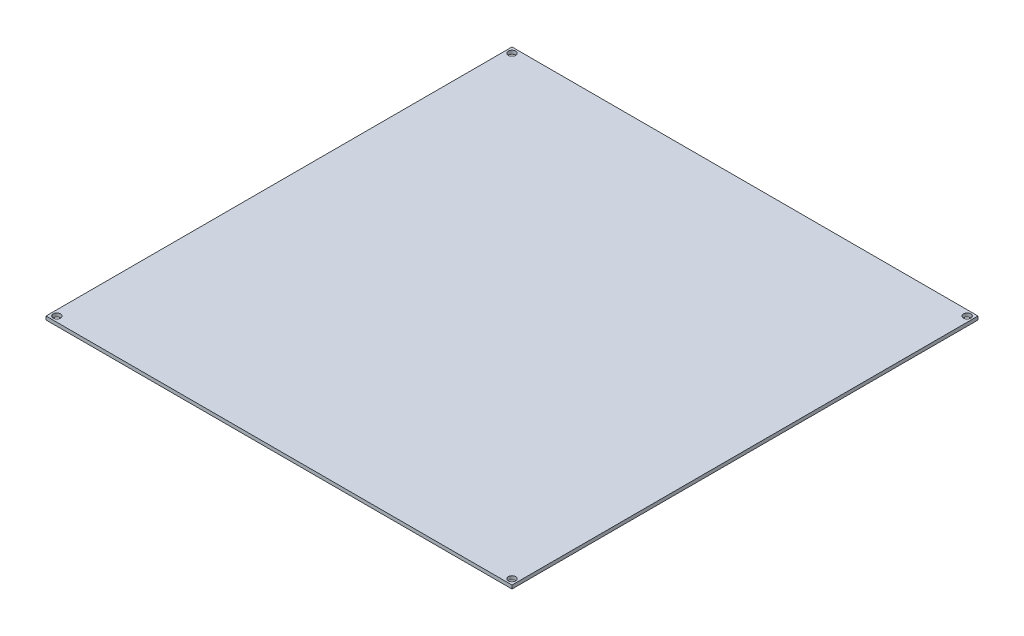
ISO-10303-21;
HEADER;
FILE_DESCRIPTION(('STEP AP214'),'2;1');
FILE_NAME('part.step','',(''),(''),'','','');
FILE_SCHEMA(('AUTOMOTIVE_DESIGN { 1 0 10303 214 1 1 1 1 }'));
ENDSEC;
DATA;
#1=APPLICATION_CONTEXT('core data for automotive mechanical design processes');
#2=APPLICATION_PROTOCOL_DEFINITION('international standard','automotive_design',2000,#1);
#3=PRODUCT_CONTEXT('',#1,'mechanical');
#4=PRODUCT('Part','Part','',(#3));
#5=PRODUCT_RELATED_PRODUCT_CATEGORY('part','',(#4));
#6=PRODUCT_DEFINITION_FORMATION('','',#4);
#7=PRODUCT_DEFINITION_CONTEXT('part definition',#1,'design');
#8=PRODUCT_DEFINITION('design','',#6,#7);
#9=PRODUCT_DEFINITION_SHAPE('','',#8);
#10=(LENGTH_UNIT() NAMED_UNIT(*) SI_UNIT(.MILLI.,.METRE.));
#11=(NAMED_UNIT(*) PLANE_ANGLE_UNIT() SI_UNIT($,.RADIAN.));
#12=(NAMED_UNIT(*) SI_UNIT($,.STERADIAN.) SOLID_ANGLE_UNIT());
#13=UNCERTAINTY_MEASURE_WITH_UNIT(LENGTH_MEASURE(1.E-05),#10,'distance_accuracy_value','');
#14=(GEOMETRIC_REPRESENTATION_CONTEXT(3) GLOBAL_UNCERTAINTY_ASSIGNED_CONTEXT((#13)) GLOBAL_UNIT_ASSIGNED_CONTEXT((#10,
#11,#12)) REPRESENTATION_CONTEXT('',''));
#15=CARTESIAN_POINT('',(0.,0.,0.));
#16=DIRECTION('',(0.,0.,1.));
#17=DIRECTION('',(1.,0.,0.));
#18=AXIS2_PLACEMENT_3D('',#15,#16,#17);
#19=CARTESIAN_POINT('',(0.,1.6,0.));
#20=DIRECTION('',(1.,0.,0.));
#21=DIRECTION('',(0.,0.,-1.));
#22=AXIS2_PLACEMENT_3D('',#19,#20,#21);
#23=PLANE('',#22);
#24=DIRECTION('',(0.,0.,1.));
#25=VECTOR('',#24,1.);
#26=CARTESIAN_POINT('',(0.,0.,0.));
#27=LINE('',#26,#25);
#28=CARTESIAN_POINT('',(0.,0.,-214.));
#29=VERTEX_POINT('',#28);
#30=CARTESIAN_POINT('',(0.,0.,0.));
#31=VERTEX_POINT('',#30);
#32=EDGE_CURVE('E99',#29,#31,#27,.T.);
#33=ORIENTED_EDGE('',*,*,#32,.T.);
#34=DIRECTION('',(0.,-1.,0.));
#35=VECTOR('',#34,1.);
#36=CARTESIAN_POINT('',(0.,1.6,0.));
#37=LINE('',#36,#35);
#38=CARTESIAN_POINT('',(0.,1.6,0.));
#39=VERTEX_POINT('',#38);
#40=EDGE_CURVE('E11',#39,#31,#37,.T.);
#41=ORIENTED_EDGE('',*,*,#40,.F.);
#42=DIRECTION('',(0.,0.,1.));
#43=VECTOR('',#42,1.);
#44=CARTESIAN_POINT('',(0.,1.6,0.));
#45=LINE('',#44,#43);
#46=CARTESIAN_POINT('',(0.,1.6,-214.));
#47=VERTEX_POINT('',#46);
#48=EDGE_CURVE('E87',#47,#39,#45,.T.);
#49=ORIENTED_EDGE('',*,*,#48,.F.);
#50=DIRECTION('',(0.,-1.,0.));
#51=VECTOR('',#50,1.);
#52=CARTESIAN_POINT('',(0.,1.6,-214.));
#53=LINE('',#52,#51);
#54=EDGE_CURVE('E95',#47,#29,#53,.T.);
#55=ORIENTED_EDGE('',*,*,#54,.T.);
#56=EDGE_LOOP('',(#33,#41,#49,#55));
#57=FACE_BOUND('',#56,.T.);
#58=ADVANCED_FACE('F36',(#57),#23,.F.);
#59=CARTESIAN_POINT('',(0.,1.6,0.));
#60=DIRECTION('',(0.,0.,-1.));
#61=DIRECTION('',(-1.,0.,0.));
#62=AXIS2_PLACEMENT_3D('',#59,#60,#61);
#63=PLANE('',#62);
#64=DIRECTION('',(1.,0.,0.));
#65=VECTOR('',#64,1.);
#66=CARTESIAN_POINT('',(0.,0.,0.));
#67=LINE('',#66,#65);
#68=CARTESIAN_POINT('',(214.,0.,0.));
#69=VERTEX_POINT('',#68);
#70=EDGE_CURVE('E91',#31,#69,#67,.T.);
#71=ORIENTED_EDGE('',*,*,#70,.T.);
#72=DIRECTION('',(0.,-1.,0.));
#73=VECTOR('',#72,1.);
#74=CARTESIAN_POINT('',(214.,1.6,0.));
#75=LINE('',#74,#73);
#76=CARTESIAN_POINT('',(214.,1.6,0.));
#77=VERTEX_POINT('',#76);
#78=EDGE_CURVE('E44',#77,#69,#75,.T.);
#79=ORIENTED_EDGE('',*,*,#78,.F.);
#80=DIRECTION('',(1.,0.,0.));
#81=VECTOR('',#80,1.);
#82=CARTESIAN_POINT('',(0.,1.6,0.));
#83=LINE('',#82,#81);
#84=EDGE_CURVE('E82',#39,#77,#83,.T.);
#85=ORIENTED_EDGE('',*,*,#84,.F.);
#86=ORIENTED_EDGE('',*,*,#40,.T.);
#87=EDGE_LOOP('',(#71,#79,#85,#86));
#88=FACE_BOUND('',#87,.T.);
#89=ADVANCED_FACE('F90',(#88),#63,.F.);
#90=CARTESIAN_POINT('',(214.,1.6,0.));
#91=DIRECTION('',(-1.,0.,0.));
#92=DIRECTION('',(0.,0.,1.));
#93=AXIS2_PLACEMENT_3D('',#90,#91,#92);
#94=PLANE('',#93);
#95=DIRECTION('',(0.,0.,-1.));
#96=VECTOR('',#95,1.);
#97=CARTESIAN_POINT('',(214.,0.,0.));
#98=LINE('',#97,#96);
#99=CARTESIAN_POINT('',(214.,0.,-214.));
#100=VERTEX_POINT('',#99);
#101=EDGE_CURVE('E69',#69,#100,#98,.T.);
#102=ORIENTED_EDGE('',*,*,#101,.T.);
#103=DIRECTION('',(0.,-1.,0.));
#104=VECTOR('',#103,1.);
#105=CARTESIAN_POINT('',(214.,1.6,-214.));
#106=LINE('',#105,#104);
#107=CARTESIAN_POINT('',(214.,1.6,-214.));
#108=VERTEX_POINT('',#107);
#109=EDGE_CURVE('E92',#108,#100,#106,.T.);
#110=ORIENTED_EDGE('',*,*,#109,.F.);
#111=DIRECTION('',(0.,0.,-1.));
#112=VECTOR('',#111,1.);
#113=CARTESIAN_POINT('',(214.,1.6,0.));
#114=LINE('',#113,#112);
#115=EDGE_CURVE('E85',#77,#108,#114,.T.);
#116=ORIENTED_EDGE('',*,*,#115,.F.);
#117=ORIENTED_EDGE('',*,*,#78,.T.);
#118=EDGE_LOOP('',(#102,#110,#116,#117));
#119=FACE_BOUND('',#118,.T.);
#120=ADVANCED_FACE('F93',(#119),#94,.F.);
#121=CARTESIAN_POINT('',(0.,1.6,-214.));
#122=DIRECTION('',(0.,0.,1.));
#123=DIRECTION('',(1.,0.,0.));
#124=AXIS2_PLACEMENT_3D('',#121,#122,#123);
#125=PLANE('',#124);
#126=DIRECTION('',(-1.,0.,0.));
#127=VECTOR('',#126,1.);
#128=CARTESIAN_POINT('',(0.,0.,-214.));
#129=LINE('',#128,#127);
#130=EDGE_CURVE('E75',#100,#29,#129,.T.);
#131=ORIENTED_EDGE('',*,*,#130,.T.);
#132=ORIENTED_EDGE('',*,*,#54,.F.);
#133=DIRECTION('',(-1.,0.,0.));
#134=VECTOR('',#133,1.);
#135=CARTESIAN_POINT('',(0.,1.6,-214.));
#136=LINE('',#135,#134);
#137=EDGE_CURVE('E52',#108,#47,#136,.T.);
#138=ORIENTED_EDGE('',*,*,#137,.F.);
#139=ORIENTED_EDGE('',*,*,#109,.T.);
#140=EDGE_LOOP('',(#131,#132,#138,#139));
#141=FACE_BOUND('',#140,.T.);
#142=ADVANCED_FACE('F107',(#141),#125,.F.);
#143=CARTESIAN_POINT('',(0.,1.6,0.));
#144=DIRECTION('',(0.,-1.,0.));
#145=DIRECTION('',(0.,0.,-1.));
#146=AXIS2_PLACEMENT_3D('',#143,#144,#145);
#147=PLANE('',#146);
#148=CARTESIAN_POINT('',(2.5,1.6,-211.5));
#149=DIRECTION('',(0.,1.,0.));
#150=DIRECTION('',(0.,0.,1.));
#151=AXIS2_PLACEMENT_3D('',#148,#149,#150);
#152=CIRCLE('',#151,1.7);
#153=CARTESIAN_POINT('',(2.5,1.6,-209.8));
#154=VERTEX_POINT('',#153);
#155=EDGE_CURVE('E133',#154,#154,#152,.T.);
#156=ORIENTED_EDGE('',*,*,#155,.F.);
#157=EDGE_LOOP('',(#156));
#158=FACE_BOUND('',#157,.T.);
#159=CARTESIAN_POINT('',(211.5,1.6,-211.5));
#160=DIRECTION('',(0.,1.,0.));
#161=DIRECTION('',(0.,0.,1.));
#162=AXIS2_PLACEMENT_3D('',#159,#160,#161);
#163=CIRCLE('',#162,1.70000000000001);
#164=CARTESIAN_POINT('',(211.5,1.6,-209.8));
#165=VERTEX_POINT('',#164);
#166=EDGE_CURVE('E127',#165,#165,#163,.T.);
#167=ORIENTED_EDGE('',*,*,#166,.F.);
#168=EDGE_LOOP('',(#167));
#169=FACE_BOUND('',#168,.T.);
#170=CARTESIAN_POINT('',(211.5,1.6,-2.5));
#171=DIRECTION('',(0.,1.,0.));
#172=DIRECTION('',(0.,0.,1.));
#173=AXIS2_PLACEMENT_3D('',#170,#171,#172);
#174=CIRCLE('',#173,1.70000000000001);
#175=CARTESIAN_POINT('',(211.5,1.6,-0.799999999999995));
#176=VERTEX_POINT('',#175);
#177=EDGE_CURVE('E121',#176,#176,#174,.T.);
#178=ORIENTED_EDGE('',*,*,#177,.F.);
#179=EDGE_LOOP('',(#178));
#180=FACE_BOUND('',#179,.T.);
#181=CARTESIAN_POINT('',(2.50000000000006,1.6,-2.49999999999995));
#182=DIRECTION('',(0.,1.,0.));
#183=DIRECTION('',(0.,0.,1.));
#184=AXIS2_PLACEMENT_3D('',#181,#182,#183);
#185=CIRCLE('',#184,1.7);
#186=CARTESIAN_POINT('',(2.50000000000006,1.6,-0.79999999999995));
#187=VERTEX_POINT('',#186);
#188=EDGE_CURVE('E115',#187,#187,#185,.T.);
#189=ORIENTED_EDGE('',*,*,#188,.F.);
#190=EDGE_LOOP('',(#189));
#191=FACE_BOUND('',#190,.T.);
#192=ORIENTED_EDGE('',*,*,#48,.T.);
#193=ORIENTED_EDGE('',*,*,#84,.T.);
#194=ORIENTED_EDGE('',*,*,#115,.T.);
#195=ORIENTED_EDGE('',*,*,#137,.T.);
#196=EDGE_LOOP('',(#192,#193,#194,#195));
#197=FACE_BOUND('',#196,.T.);
#198=ADVANCED_FACE('F83',(#158,#169,#180,#191,#197),#147,.F.);
#199=CARTESIAN_POINT('',(0.,0.,0.));
#200=DIRECTION('',(0.,-1.,0.));
#201=DIRECTION('',(0.,0.,-1.));
#202=AXIS2_PLACEMENT_3D('',#199,#200,#201);
#203=PLANE('',#202);
#204=CARTESIAN_POINT('',(2.5,0.,-211.5));
#205=DIRECTION('',(0.,1.,0.));
#206=DIRECTION('',(0.,0.,1.));
#207=AXIS2_PLACEMENT_3D('',#204,#205,#206);
#208=CIRCLE('',#207,1.7);
#209=CARTESIAN_POINT('',(2.5,0.,-209.8));
#210=VERTEX_POINT('',#209);
#211=EDGE_CURVE('E130',#210,#210,#208,.T.);
#212=ORIENTED_EDGE('',*,*,#211,.T.);
#213=EDGE_LOOP('',(#212));
#214=FACE_BOUND('',#213,.T.);
#215=CARTESIAN_POINT('',(211.5,0.,-211.5));
#216=DIRECTION('',(0.,1.,0.));
#217=DIRECTION('',(0.,0.,1.));
#218=AXIS2_PLACEMENT_3D('',#215,#216,#217);
#219=CIRCLE('',#218,1.70000000000001);
#220=CARTESIAN_POINT('',(211.5,0.,-209.8));
#221=VERTEX_POINT('',#220);
#222=EDGE_CURVE('E124',#221,#221,#219,.T.);
#223=ORIENTED_EDGE('',*,*,#222,.T.);
#224=EDGE_LOOP('',(#223));
#225=FACE_BOUND('',#224,.T.);
#226=CARTESIAN_POINT('',(211.5,0.,-2.5));
#227=DIRECTION('',(0.,1.,0.));
#228=DIRECTION('',(0.,0.,1.));
#229=AXIS2_PLACEMENT_3D('',#226,#227,#228);
#230=CIRCLE('',#229,1.70000000000001);
#231=CARTESIAN_POINT('',(211.5,0.,-0.799999999999995));
#232=VERTEX_POINT('',#231);
#233=EDGE_CURVE('E118',#232,#232,#230,.T.);
#234=ORIENTED_EDGE('',*,*,#233,.T.);
#235=EDGE_LOOP('',(#234));
#236=FACE_BOUND('',#235,.T.);
#237=CARTESIAN_POINT('',(2.50000000000006,0.,-2.49999999999995));
#238=DIRECTION('',(0.,1.,0.));
#239=DIRECTION('',(0.,0.,1.));
#240=AXIS2_PLACEMENT_3D('',#237,#238,#239);
#241=CIRCLE('',#240,1.7);
#242=CARTESIAN_POINT('',(2.50000000000006,0.,-0.799999999999951));
#243=VERTEX_POINT('',#242);
#244=EDGE_CURVE('E102',#243,#243,#241,.T.);
#245=ORIENTED_EDGE('',*,*,#244,.T.);
#246=EDGE_LOOP('',(#245));
#247=FACE_BOUND('',#246,.T.);
#248=ORIENTED_EDGE('',*,*,#32,.F.);
#249=ORIENTED_EDGE('',*,*,#130,.F.);
#250=ORIENTED_EDGE('',*,*,#101,.F.);
#251=ORIENTED_EDGE('',*,*,#70,.F.);
#252=EDGE_LOOP('',(#248,#249,#250,#251));
#253=FACE_BOUND('',#252,.T.);
#254=ADVANCED_FACE('F110',(#214,#225,#236,#247,#253),#203,.T.);
#255=CARTESIAN_POINT('',(2.50000000000006,1.6,-2.49999999999995));
#256=DIRECTION('',(0.,1.,0.));
#257=DIRECTION('',(0.,0.,1.));
#258=AXIS2_PLACEMENT_3D('',#255,#256,#257);
#259=CYLINDRICAL_SURFACE('',#258,1.7);
#260=ORIENTED_EDGE('',*,*,#244,.F.);
#261=EDGE_LOOP('',(#260));
#262=FACE_BOUND('',#261,.T.);
#263=ORIENTED_EDGE('',*,*,#188,.T.);
#264=EDGE_LOOP('',(#263));
#265=FACE_BOUND('',#264,.T.);
#266=ADVANCED_FACE('F148',(#262,#265),#259,.F.);
#267=CARTESIAN_POINT('',(211.5,1.6,-2.5));
#268=DIRECTION('',(0.,1.,0.));
#269=DIRECTION('',(0.,0.,1.));
#270=AXIS2_PLACEMENT_3D('',#267,#268,#269);
#271=CYLINDRICAL_SURFACE('',#270,1.70000000000001);
#272=ORIENTED_EDGE('',*,*,#233,.F.);
#273=EDGE_LOOP('',(#272));
#274=FACE_BOUND('',#273,.T.);
#275=ORIENTED_EDGE('',*,*,#177,.T.);
#276=EDGE_LOOP('',(#275));
#277=FACE_BOUND('',#276,.T.);
#278=ADVANCED_FACE('F150',(#274,#277),#271,.F.);
#279=CARTESIAN_POINT('',(211.5,1.6,-211.5));
#280=DIRECTION('',(0.,1.,0.));
#281=DIRECTION('',(0.,0.,1.));
#282=AXIS2_PLACEMENT_3D('',#279,#280,#281);
#283=CYLINDRICAL_SURFACE('',#282,1.70000000000001);
#284=ORIENTED_EDGE('',*,*,#222,.F.);
#285=EDGE_LOOP('',(#284));
#286=FACE_BOUND('',#285,.T.);
#287=ORIENTED_EDGE('',*,*,#166,.T.);
#288=EDGE_LOOP('',(#287));
#289=FACE_BOUND('',#288,.T.);
#290=ADVANCED_FACE('F157',(#286,#289),#283,.F.);
#291=CARTESIAN_POINT('',(2.5,1.6,-211.5));
#292=DIRECTION('',(0.,1.,0.));
#293=DIRECTION('',(0.,0.,1.));
#294=AXIS2_PLACEMENT_3D('',#291,#292,#293);
#295=CYLINDRICAL_SURFACE('',#294,1.7);
#296=ORIENTED_EDGE('',*,*,#211,.F.);
#297=EDGE_LOOP('',(#296));
#298=FACE_BOUND('',#297,.T.);
#299=ORIENTED_EDGE('',*,*,#155,.T.);
#300=EDGE_LOOP('',(#299));
#301=FACE_BOUND('',#300,.T.);
#302=ADVANCED_FACE('F137',(#298,#301),#295,.F.);
#303=CLOSED_SHELL('',(#58,#89,#120,#142,#198,#254,#266,#278,#290,#302));
#304=MANIFOLD_SOLID_BREP('B2',#303);
#305=ADVANCED_BREP_SHAPE_REPRESENTATION('',(#18,#304),#14);
#306=SHAPE_DEFINITION_REPRESENTATION(#9,#305);
ENDSEC;
END-ISO-10303-21;
